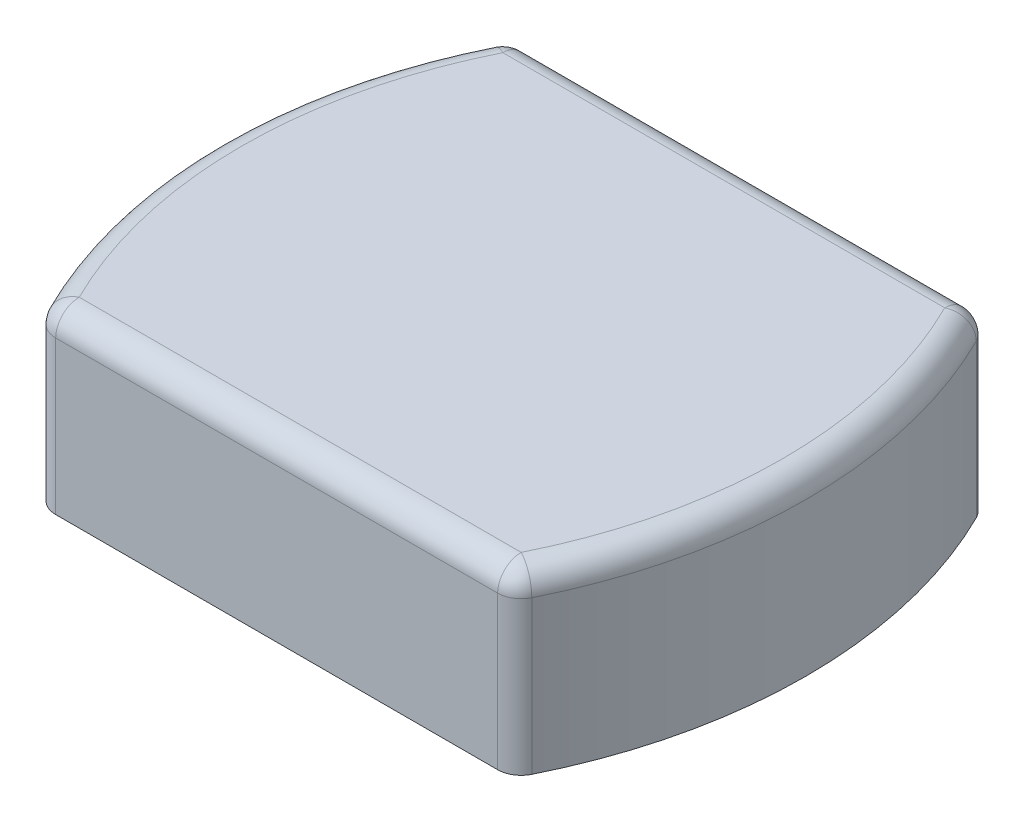
ISO-10303-21;
HEADER;
FILE_DESCRIPTION(('STEP AP214'),'2;1');
FILE_NAME('part.step','',(''),(''),'','','');
FILE_SCHEMA(('AUTOMOTIVE_DESIGN { 1 0 10303 214 1 1 1 1 }'));
ENDSEC;
DATA;
#1=APPLICATION_CONTEXT('core data for automotive mechanical design processes');
#2=APPLICATION_PROTOCOL_DEFINITION('international standard','automotive_design',2000,#1);
#3=PRODUCT_CONTEXT('',#1,'mechanical');
#4=PRODUCT('Part','Part','',(#3));
#5=PRODUCT_RELATED_PRODUCT_CATEGORY('part','',(#4));
#6=PRODUCT_DEFINITION_FORMATION('','',#4);
#7=PRODUCT_DEFINITION_CONTEXT('part definition',#1,'design');
#8=PRODUCT_DEFINITION('design','',#6,#7);
#9=PRODUCT_DEFINITION_SHAPE('','',#8);
#10=(LENGTH_UNIT() NAMED_UNIT(*) SI_UNIT(.MILLI.,.METRE.));
#11=(NAMED_UNIT(*) PLANE_ANGLE_UNIT() SI_UNIT($,.RADIAN.));
#12=(NAMED_UNIT(*) SI_UNIT($,.STERADIAN.) SOLID_ANGLE_UNIT());
#13=UNCERTAINTY_MEASURE_WITH_UNIT(LENGTH_MEASURE(1.E-05),#10,'distance_accuracy_value','');
#14=(GEOMETRIC_REPRESENTATION_CONTEXT(3) GLOBAL_UNCERTAINTY_ASSIGNED_CONTEXT((#13)) GLOBAL_UNIT_ASSIGNED_CONTEXT((#10,
#11,#12)) REPRESENTATION_CONTEXT('',''));
#15=CARTESIAN_POINT('',(0.,0.,0.));
#16=DIRECTION('',(0.,0.,1.));
#17=DIRECTION('',(1.,0.,0.));
#18=AXIS2_PLACEMENT_3D('',#15,#16,#17);
#19=CARTESIAN_POINT('',(22.2249999999999,19.05,0.));
#20=DIRECTION('',(0.,-1.,0.));
#21=DIRECTION('',(0.,0.,-1.));
#22=AXIS2_PLACEMENT_3D('',#19,#20,#21);
#23=CYLINDRICAL_SURFACE('',#22,53.975);
#24=CARTESIAN_POINT('',(22.2249999999999,0.,0.));
#25=DIRECTION('',(0.,1.,0.));
#26=DIRECTION('',(0.,0.,1.));
#27=AXIS2_PLACEMENT_3D('',#24,#25,#26);
#28=CIRCLE('',#27,53.975);
#29=CARTESIAN_POINT('',(-26.1261513293794,0.,23.9888888888889));
#30=VERTEX_POINT('',#29);
#31=CARTESIAN_POINT('',(-26.1261513293794,0.,-23.9888888888889));
#32=VERTEX_POINT('',#31);
#33=EDGE_CURVE('E181',#30,#32,#28,.F.);
#34=ORIENTED_EDGE('',*,*,#33,.F.);
#35=DIRECTION('',(0.,-1.,0.));
#36=VECTOR('',#35,1.);
#37=CARTESIAN_POINT('',(-26.1261513293794,19.05,23.9888888888889));
#38=LINE('',#37,#36);
#39=CARTESIAN_POINT('',(-26.1261513293794,16.51,23.9888888888889));
#40=VERTEX_POINT('',#39);
#41=EDGE_CURVE('E218',#30,#40,#38,.F.);
#42=ORIENTED_EDGE('',*,*,#41,.T.);
#43=CARTESIAN_POINT('',(22.2249999999999,16.51,0.));
#44=DIRECTION('',(0.,1.,0.));
#45=DIRECTION('',(0.,0.,1.));
#46=AXIS2_PLACEMENT_3D('',#43,#44,#45);
#47=CIRCLE('',#46,53.975);
#48=CARTESIAN_POINT('',(-26.1261513293794,16.51,-23.9888888888889));
#49=VERTEX_POINT('',#48);
#50=EDGE_CURVE('E216',#40,#49,#47,.F.);
#51=ORIENTED_EDGE('',*,*,#50,.T.);
#52=DIRECTION('',(0.,-1.,0.));
#53=VECTOR('',#52,1.);
#54=CARTESIAN_POINT('',(-26.1261513293794,19.05,-23.9888888888889));
#55=LINE('',#54,#53);
#56=EDGE_CURVE('E214',#49,#32,#55,.T.);
#57=ORIENTED_EDGE('',*,*,#56,.T.);
#58=EDGE_LOOP('',(#34,#42,#51,#57));
#59=FACE_BOUND('',#58,.T.);
#60=ADVANCED_FACE('F42',(#59),#23,.T.);
#61=CARTESIAN_POINT('',(0.,19.05,25.4));
#62=DIRECTION('',(0.,0.,-1.));
#63=DIRECTION('',(-1.,0.,0.));
#64=AXIS2_PLACEMENT_3D('',#61,#62,#63);
#65=PLANE('',#64);
#66=DIRECTION('',(1.,0.,0.));
#67=VECTOR('',#66,1.);
#68=CARTESIAN_POINT('',(0.,0.,25.4));
#69=LINE('',#68,#67);
#70=CARTESIAN_POINT('',(-23.8508030315262,0.,25.4));
#71=VERTEX_POINT('',#70);
#72=CARTESIAN_POINT('',(23.8508030315262,0.,25.4));
#73=VERTEX_POINT('',#72);
#74=EDGE_CURVE('E184',#71,#73,#69,.T.);
#75=ORIENTED_EDGE('',*,*,#74,.T.);
#76=DIRECTION('',(0.,1.,0.));
#77=VECTOR('',#76,1.);
#78=CARTESIAN_POINT('',(23.8508030315262,19.05,25.4));
#79=LINE('',#78,#77);
#80=CARTESIAN_POINT('',(23.8508030315262,16.51,25.4));
#81=VERTEX_POINT('',#80);
#82=EDGE_CURVE('E212',#73,#81,#79,.T.);
#83=ORIENTED_EDGE('',*,*,#82,.T.);
#84=DIRECTION('',(1.,0.,0.));
#85=VECTOR('',#84,1.);
#86=CARTESIAN_POINT('',(-25.4,16.51,25.4));
#87=LINE('',#86,#85);
#88=CARTESIAN_POINT('',(-23.8508030315262,16.51,25.4));
#89=VERTEX_POINT('',#88);
#90=EDGE_CURVE('E208',#81,#89,#87,.F.);
#91=ORIENTED_EDGE('',*,*,#90,.T.);
#92=DIRECTION('',(0.,1.,0.));
#93=VECTOR('',#92,1.);
#94=CARTESIAN_POINT('',(-23.8508030315262,0.,25.4));
#95=LINE('',#94,#93);
#96=EDGE_CURVE('E210',#89,#71,#95,.F.);
#97=ORIENTED_EDGE('',*,*,#96,.T.);
#98=EDGE_LOOP('',(#75,#83,#91,#97));
#99=FACE_BOUND('',#98,.T.);
#100=ADVANCED_FACE('F291',(#99),#65,.F.);
#101=CARTESIAN_POINT('',(-22.2249999999999,19.05,0.));
#102=DIRECTION('',(0.,-1.,0.));
#103=DIRECTION('',(0.,0.,-1.));
#104=AXIS2_PLACEMENT_3D('',#101,#102,#103);
#105=CYLINDRICAL_SURFACE('',#104,53.975);
#106=CARTESIAN_POINT('',(-22.2249999999999,16.51,0.));
#107=DIRECTION('',(0.,1.,0.));
#108=DIRECTION('',(0.,0.,1.));
#109=AXIS2_PLACEMENT_3D('',#106,#107,#108);
#110=CIRCLE('',#109,53.975);
#111=CARTESIAN_POINT('',(26.1261513293794,16.51,-23.9888888888889));
#112=VERTEX_POINT('',#111);
#113=CARTESIAN_POINT('',(26.1261513293794,16.51,23.9888888888889));
#114=VERTEX_POINT('',#113);
#115=EDGE_CURVE('E195',#112,#114,#110,.F.);
#116=ORIENTED_EDGE('',*,*,#115,.T.);
#117=DIRECTION('',(0.,-1.,0.));
#118=VECTOR('',#117,1.);
#119=CARTESIAN_POINT('',(26.1261513293794,19.05,23.9888888888889));
#120=LINE('',#119,#118);
#121=CARTESIAN_POINT('',(26.1261513293794,0.,23.9888888888889));
#122=VERTEX_POINT('',#121);
#123=EDGE_CURVE('E197',#114,#122,#120,.T.);
#124=ORIENTED_EDGE('',*,*,#123,.T.);
#125=CARTESIAN_POINT('',(-22.2249999999999,0.,0.));
#126=DIRECTION('',(0.,1.,0.));
#127=DIRECTION('',(0.,0.,1.));
#128=AXIS2_PLACEMENT_3D('',#125,#126,#127);
#129=CIRCLE('',#128,53.975);
#130=CARTESIAN_POINT('',(26.1261513293794,0.,-23.9888888888889));
#131=VERTEX_POINT('',#130);
#132=EDGE_CURVE('E187',#131,#122,#129,.F.);
#133=ORIENTED_EDGE('',*,*,#132,.F.);
#134=DIRECTION('',(0.,-1.,0.));
#135=VECTOR('',#134,1.);
#136=CARTESIAN_POINT('',(26.1261513293794,19.05,-23.9888888888889));
#137=LINE('',#136,#135);
#138=EDGE_CURVE('E193',#131,#112,#137,.F.);
#139=ORIENTED_EDGE('',*,*,#138,.T.);
#140=EDGE_LOOP('',(#116,#124,#133,#139));
#141=FACE_BOUND('',#140,.T.);
#142=ADVANCED_FACE('F297',(#141),#105,.T.);
#143=CARTESIAN_POINT('',(0.,19.05,-25.4));
#144=DIRECTION('',(0.,0.,-1.));
#145=DIRECTION('',(-1.,0.,0.));
#146=AXIS2_PLACEMENT_3D('',#143,#144,#145);
#147=PLANE('',#146);
#148=DIRECTION('',(1.,0.,0.));
#149=VECTOR('',#148,1.);
#150=CARTESIAN_POINT('',(0.,0.,-25.4));
#151=LINE('',#150,#149);
#152=CARTESIAN_POINT('',(-23.8508030315262,0.,-25.4));
#153=VERTEX_POINT('',#152);
#154=CARTESIAN_POINT('',(23.8508030315262,0.,-25.4));
#155=VERTEX_POINT('',#154);
#156=EDGE_CURVE('E190',#153,#155,#151,.T.);
#157=ORIENTED_EDGE('',*,*,#156,.F.);
#158=DIRECTION('',(0.,-1.,0.));
#159=VECTOR('',#158,1.);
#160=CARTESIAN_POINT('',(-23.8508030315262,19.05,-25.4));
#161=LINE('',#160,#159);
#162=CARTESIAN_POINT('',(-23.8508030315262,16.51,-25.4));
#163=VERTEX_POINT('',#162);
#164=EDGE_CURVE('E12',#153,#163,#161,.F.);
#165=ORIENTED_EDGE('',*,*,#164,.T.);
#166=DIRECTION('',(1.,0.,0.));
#167=VECTOR('',#166,1.);
#168=CARTESIAN_POINT('',(0.,16.51,-25.4));
#169=LINE('',#168,#167);
#170=CARTESIAN_POINT('',(23.8508030315262,16.51,-25.4));
#171=VERTEX_POINT('',#170);
#172=EDGE_CURVE('E51',#163,#171,#169,.T.);
#173=ORIENTED_EDGE('',*,*,#172,.T.);
#174=DIRECTION('',(0.,-1.,0.));
#175=VECTOR('',#174,1.);
#176=CARTESIAN_POINT('',(23.8508030315262,19.05,-25.4));
#177=LINE('',#176,#175);
#178=EDGE_CURVE('E229',#171,#155,#177,.T.);
#179=ORIENTED_EDGE('',*,*,#178,.T.);
#180=EDGE_LOOP('',(#157,#165,#173,#179));
#181=FACE_BOUND('',#180,.T.);
#182=ADVANCED_FACE('F351',(#181),#147,.T.);
#183=CARTESIAN_POINT('',(0.,19.05,0.));
#184=DIRECTION('',(0.,1.,0.));
#185=DIRECTION('',(0.,0.,1.));
#186=AXIS2_PLACEMENT_3D('',#183,#184,#185);
#187=PLANE('',#186);
#188=CARTESIAN_POINT('',(22.2249999999999,19.05,0.));
#189=DIRECTION('',(0.,1.,0.));
#190=DIRECTION('',(0.,0.,1.));
#191=AXIS2_PLACEMENT_3D('',#188,#189,#190);
#192=CIRCLE('',#191,51.435);
#193=CARTESIAN_POINT('',(-23.8508030315262,19.05,-22.86));
#194=VERTEX_POINT('',#193);
#195=CARTESIAN_POINT('',(-23.8508030315262,19.05,22.86));
#196=VERTEX_POINT('',#195);
#197=EDGE_CURVE('E222',#194,#196,#192,.T.);
#198=ORIENTED_EDGE('',*,*,#197,.T.);
#199=DIRECTION('',(1.,0.,0.));
#200=VECTOR('',#199,1.);
#201=CARTESIAN_POINT('',(25.4,19.05,22.86));
#202=LINE('',#201,#200);
#203=CARTESIAN_POINT('',(23.8508030315262,19.05,22.86));
#204=VERTEX_POINT('',#203);
#205=EDGE_CURVE('E226',#196,#204,#202,.T.);
#206=ORIENTED_EDGE('',*,*,#205,.T.);
#207=CARTESIAN_POINT('',(-22.2249999999999,19.05,0.));
#208=DIRECTION('',(0.,1.,0.));
#209=DIRECTION('',(0.,0.,1.));
#210=AXIS2_PLACEMENT_3D('',#207,#208,#209);
#211=CIRCLE('',#210,51.435);
#212=CARTESIAN_POINT('',(23.8508030315262,19.05,-22.86));
#213=VERTEX_POINT('',#212);
#214=EDGE_CURVE('E224',#204,#213,#211,.T.);
#215=ORIENTED_EDGE('',*,*,#214,.T.);
#216=DIRECTION('',(1.,0.,0.));
#217=VECTOR('',#216,1.);
#218=CARTESIAN_POINT('',(0.,19.05,-22.86));
#219=LINE('',#218,#217);
#220=EDGE_CURVE('E220',#213,#194,#219,.F.);
#221=ORIENTED_EDGE('',*,*,#220,.T.);
#222=EDGE_LOOP('',(#198,#206,#215,#221));
#223=FACE_BOUND('',#222,.T.);
#224=ADVANCED_FACE('F366',(#223),#187,.T.);
#225=CARTESIAN_POINT('',(0.,0.,0.));
#226=DIRECTION('',(0.,1.,0.));
#227=DIRECTION('',(0.,0.,1.));
#228=AXIS2_PLACEMENT_3D('',#225,#226,#227);
#229=PLANE('',#228);
#230=DIRECTION('',(0.,0.,-1.));
#231=VECTOR('',#230,1.);
#232=CARTESIAN_POINT('',(-22.86,0.,20.32));
#233=LINE('',#232,#231);
#234=CARTESIAN_POINT('',(-22.86,0.,20.32));
#235=VERTEX_POINT('',#234);
#236=CARTESIAN_POINT('',(-22.86,0.,-20.32));
#237=VERTEX_POINT('',#236);
#238=EDGE_CURVE('E166',#235,#237,#233,.T.);
#239=ORIENTED_EDGE('',*,*,#238,.F.);
#240=DIRECTION('',(-1.,0.,0.));
#241=VECTOR('',#240,1.);
#242=CARTESIAN_POINT('',(-22.86,0.,20.32));
#243=LINE('',#242,#241);
#244=CARTESIAN_POINT('',(22.86,0.,20.32));
#245=VERTEX_POINT('',#244);
#246=EDGE_CURVE('E158',#245,#235,#243,.T.);
#247=ORIENTED_EDGE('',*,*,#246,.F.);
#248=DIRECTION('',(0.,0.,1.));
#249=VECTOR('',#248,1.);
#250=CARTESIAN_POINT('',(22.86,0.,20.32));
#251=LINE('',#250,#249);
#252=CARTESIAN_POINT('',(22.86,0.,-20.32));
#253=VERTEX_POINT('',#252);
#254=EDGE_CURVE('E170',#253,#245,#251,.T.);
#255=ORIENTED_EDGE('',*,*,#254,.F.);
#256=DIRECTION('',(1.,0.,0.));
#257=VECTOR('',#256,1.);
#258=CARTESIAN_POINT('',(-22.86,0.,-20.32));
#259=LINE('',#258,#257);
#260=EDGE_CURVE('E164',#237,#253,#259,.T.);
#261=ORIENTED_EDGE('',*,*,#260,.F.);
#262=EDGE_LOOP('',(#239,#247,#255,#261));
#263=FACE_BOUND('',#262,.T.);
#264=ORIENTED_EDGE('',*,*,#132,.T.);
#265=CARTESIAN_POINT('',(23.8508030315262,0.,22.86));
#266=DIRECTION('',(0.,1.,0.));
#267=DIRECTION('',(0.,0.,1.));
#268=AXIS2_PLACEMENT_3D('',#265,#266,#267);
#269=CIRCLE('',#268,2.54);
#270=EDGE_CURVE('E206',#122,#73,#269,.F.);
#271=ORIENTED_EDGE('',*,*,#270,.T.);
#272=ORIENTED_EDGE('',*,*,#74,.F.);
#273=CARTESIAN_POINT('',(-23.8508030315262,0.,22.86));
#274=DIRECTION('',(0.,1.,0.));
#275=DIRECTION('',(0.,0.,1.));
#276=AXIS2_PLACEMENT_3D('',#273,#274,#275);
#277=CIRCLE('',#276,2.54);
#278=EDGE_CURVE('E204',#71,#30,#277,.F.);
#279=ORIENTED_EDGE('',*,*,#278,.T.);
#280=ORIENTED_EDGE('',*,*,#33,.T.);
#281=CARTESIAN_POINT('',(-23.8508030315262,0.,-22.86));
#282=DIRECTION('',(0.,1.,0.));
#283=DIRECTION('',(0.,0.,1.));
#284=AXIS2_PLACEMENT_3D('',#281,#282,#283);
#285=CIRCLE('',#284,2.54);
#286=EDGE_CURVE('E202',#32,#153,#285,.F.);
#287=ORIENTED_EDGE('',*,*,#286,.T.);
#288=ORIENTED_EDGE('',*,*,#156,.T.);
#289=CARTESIAN_POINT('',(23.8508030315262,0.,-22.86));
#290=DIRECTION('',(0.,1.,0.));
#291=DIRECTION('',(0.,0.,1.));
#292=AXIS2_PLACEMENT_3D('',#289,#290,#291);
#293=CIRCLE('',#292,2.54);
#294=EDGE_CURVE('E200',#155,#131,#293,.F.);
#295=ORIENTED_EDGE('',*,*,#294,.T.);
#296=EDGE_LOOP('',(#264,#271,#272,#279,#280,#287,#288,#295));
#297=FACE_BOUND('',#296,.T.);
#298=ADVANCED_FACE('F275',(#263,#297),#229,.F.);
#299=CARTESIAN_POINT('',(0.,15.875,0.));
#300=DIRECTION('',(0.,1.,0.));
#301=DIRECTION('',(0.,0.,1.));
#302=AXIS2_PLACEMENT_3D('',#299,#300,#301);
#303=PLANE('',#302);
#304=DIRECTION('',(0.,0.,1.));
#305=VECTOR('',#304,1.);
#306=CARTESIAN_POINT('',(22.86,15.875,20.32));
#307=LINE('',#306,#305);
#308=CARTESIAN_POINT('',(22.86,15.875,-20.32));
#309=VERTEX_POINT('',#308);
#310=CARTESIAN_POINT('',(22.86,15.875,20.32));
#311=VERTEX_POINT('',#310);
#312=EDGE_CURVE('E162',#309,#311,#307,.T.);
#313=ORIENTED_EDGE('',*,*,#312,.T.);
#314=DIRECTION('',(-1.,0.,0.));
#315=VECTOR('',#314,1.);
#316=CARTESIAN_POINT('',(-22.86,15.875,20.32));
#317=LINE('',#316,#315);
#318=CARTESIAN_POINT('',(-22.86,15.875,20.32));
#319=VERTEX_POINT('',#318);
#320=EDGE_CURVE('E155',#311,#319,#317,.T.);
#321=ORIENTED_EDGE('',*,*,#320,.T.);
#322=DIRECTION('',(0.,0.,-1.));
#323=VECTOR('',#322,1.);
#324=CARTESIAN_POINT('',(-22.86,15.875,20.32));
#325=LINE('',#324,#323);
#326=CARTESIAN_POINT('',(-22.86,15.875,-20.32));
#327=VERTEX_POINT('',#326);
#328=EDGE_CURVE('E142',#319,#327,#325,.T.);
#329=ORIENTED_EDGE('',*,*,#328,.T.);
#330=DIRECTION('',(1.,0.,0.));
#331=VECTOR('',#330,1.);
#332=CARTESIAN_POINT('',(-22.86,15.875,-20.32));
#333=LINE('',#332,#331);
#334=EDGE_CURVE('E175',#327,#309,#333,.T.);
#335=ORIENTED_EDGE('',*,*,#334,.T.);
#336=EDGE_LOOP('',(#313,#321,#329,#335));
#337=FACE_BOUND('',#336,.T.);
#338=ADVANCED_FACE('F161',(#337),#303,.F.);
#339=CARTESIAN_POINT('',(-22.86,80.2213004602649,20.32));
#340=DIRECTION('',(0.,0.,1.));
#341=DIRECTION('',(1.,0.,0.));
#342=AXIS2_PLACEMENT_3D('',#339,#340,#341);
#343=PLANE('',#342);
#344=DIRECTION('',(0.,-1.,0.));
#345=VECTOR('',#344,1.);
#346=CARTESIAN_POINT('',(22.86,80.2213004602649,20.32));
#347=LINE('',#346,#345);
#348=EDGE_CURVE('E173',#311,#245,#347,.T.);
#349=ORIENTED_EDGE('',*,*,#348,.T.);
#350=ORIENTED_EDGE('',*,*,#246,.T.);
#351=DIRECTION('',(0.,-1.,0.));
#352=VECTOR('',#351,1.);
#353=CARTESIAN_POINT('',(-22.86,80.2213004602649,20.32));
#354=LINE('',#353,#352);
#355=EDGE_CURVE('E146',#319,#235,#354,.T.);
#356=ORIENTED_EDGE('',*,*,#355,.F.);
#357=ORIENTED_EDGE('',*,*,#320,.F.);
#358=EDGE_LOOP('',(#349,#350,#356,#357));
#359=FACE_BOUND('',#358,.T.);
#360=ADVANCED_FACE('F154',(#359),#343,.F.);
#361=CARTESIAN_POINT('',(-22.86,80.2213004602649,20.32));
#362=DIRECTION('',(-1.,0.,0.));
#363=DIRECTION('',(0.,0.,1.));
#364=AXIS2_PLACEMENT_3D('',#361,#362,#363);
#365=PLANE('',#364);
#366=ORIENTED_EDGE('',*,*,#355,.T.);
#367=ORIENTED_EDGE('',*,*,#238,.T.);
#368=DIRECTION('',(0.,-1.,0.));
#369=VECTOR('',#368,1.);
#370=CARTESIAN_POINT('',(-22.86,80.2213004602649,-20.32));
#371=LINE('',#370,#369);
#372=EDGE_CURVE('E148',#327,#237,#371,.T.);
#373=ORIENTED_EDGE('',*,*,#372,.F.);
#374=ORIENTED_EDGE('',*,*,#328,.F.);
#375=EDGE_LOOP('',(#366,#367,#373,#374));
#376=FACE_BOUND('',#375,.T.);
#377=ADVANCED_FACE('F144',(#376),#365,.F.);
#378=CARTESIAN_POINT('',(-22.86,80.2213004602649,-20.32));
#379=DIRECTION('',(0.,0.,-1.));
#380=DIRECTION('',(-1.,0.,0.));
#381=AXIS2_PLACEMENT_3D('',#378,#379,#380);
#382=PLANE('',#381);
#383=ORIENTED_EDGE('',*,*,#372,.T.);
#384=ORIENTED_EDGE('',*,*,#260,.T.);
#385=DIRECTION('',(0.,-1.,0.));
#386=VECTOR('',#385,1.);
#387=CARTESIAN_POINT('',(22.86,80.2213004602649,-20.32));
#388=LINE('',#387,#386);
#389=EDGE_CURVE('E174',#309,#253,#388,.T.);
#390=ORIENTED_EDGE('',*,*,#389,.F.);
#391=ORIENTED_EDGE('',*,*,#334,.F.);
#392=EDGE_LOOP('',(#383,#384,#390,#391));
#393=FACE_BOUND('',#392,.T.);
#394=ADVANCED_FACE('F279',(#393),#382,.F.);
#395=CARTESIAN_POINT('',(22.86,80.2213004602649,20.32));
#396=DIRECTION('',(1.,0.,0.));
#397=DIRECTION('',(0.,0.,-1.));
#398=AXIS2_PLACEMENT_3D('',#395,#396,#397);
#399=PLANE('',#398);
#400=ORIENTED_EDGE('',*,*,#389,.T.);
#401=ORIENTED_EDGE('',*,*,#254,.T.);
#402=ORIENTED_EDGE('',*,*,#348,.F.);
#403=ORIENTED_EDGE('',*,*,#312,.F.);
#404=EDGE_LOOP('',(#400,#401,#402,#403));
#405=FACE_BOUND('',#404,.T.);
#406=ADVANCED_FACE('F280',(#405),#399,.F.);
#407=CARTESIAN_POINT('',(-23.8508030315262,19.05,-22.86));
#408=DIRECTION('',(0.,-1.,0.));
#409=DIRECTION('',(0.,0.,-1.));
#410=AXIS2_PLACEMENT_3D('',#407,#408,#409);
#411=CYLINDRICAL_SURFACE('',#410,2.54);
#412=CARTESIAN_POINT('',(-23.8508030315262,16.51,-22.86));
#413=DIRECTION('',(0.,1.,0.));
#414=DIRECTION('',(0.,0.,1.));
#415=AXIS2_PLACEMENT_3D('',#412,#413,#414);
#416=CIRCLE('',#415,2.54);
#417=EDGE_CURVE('E46',#163,#49,#416,.T.);
#418=ORIENTED_EDGE('',*,*,#417,.F.);
#419=ORIENTED_EDGE('',*,*,#164,.F.);
#420=ORIENTED_EDGE('',*,*,#286,.F.);
#421=ORIENTED_EDGE('',*,*,#56,.F.);
#422=EDGE_LOOP('',(#418,#419,#420,#421));
#423=FACE_BOUND('',#422,.T.);
#424=ADVANCED_FACE('F44',(#423),#411,.T.);
#425=CARTESIAN_POINT('',(-23.8508030315262,16.51,-22.86));
#426=DIRECTION('',(0.,0.,1.));
#427=DIRECTION('',(1.,0.,0.));
#428=AXIS2_PLACEMENT_3D('',#425,#426,#427);
#429=SPHERICAL_SURFACE('',#428,2.54);
#430=CARTESIAN_POINT('',(-23.8508030315262,16.51,-22.86));
#431=DIRECTION('',(-1.,0.,0.));
#432=DIRECTION('',(0.,0.,1.));
#433=AXIS2_PLACEMENT_3D('',#430,#431,#432);
#434=CIRCLE('',#433,2.54);
#435=EDGE_CURVE('E258',#163,#194,#434,.F.);
#436=ORIENTED_EDGE('',*,*,#435,.F.);
#437=ORIENTED_EDGE('',*,*,#417,.T.);
#438=CARTESIAN_POINT('',(-23.8508030315262,16.51,-22.86));
#439=DIRECTION('',(0.444444444444445,0.,-0.895806416477616));
#440=DIRECTION('',(-0.895806416477616,0.,-0.444444444444445));
#441=AXIS2_PLACEMENT_3D('',#438,#439,#440);
#442=CIRCLE('',#441,2.54);
#443=EDGE_CURVE('E260',#194,#49,#442,.F.);
#444=ORIENTED_EDGE('',*,*,#443,.F.);
#445=EDGE_LOOP('',(#436,#437,#444));
#446=FACE_BOUND('',#445,.T.);
#447=ADVANCED_FACE('F287',(#446),#429,.T.);
#448=CARTESIAN_POINT('',(-23.8508030315262,19.05,22.86));
#449=DIRECTION('',(0.,-1.,0.));
#450=DIRECTION('',(0.,0.,-1.));
#451=AXIS2_PLACEMENT_3D('',#448,#449,#450);
#452=CYLINDRICAL_SURFACE('',#451,2.54);
#453=ORIENTED_EDGE('',*,*,#278,.F.);
#454=ORIENTED_EDGE('',*,*,#96,.F.);
#455=CARTESIAN_POINT('',(-23.8508030315262,16.51,22.86));
#456=DIRECTION('',(0.,1.,0.));
#457=DIRECTION('',(0.,0.,1.));
#458=AXIS2_PLACEMENT_3D('',#455,#456,#457);
#459=CIRCLE('',#458,2.54);
#460=EDGE_CURVE('E255',#40,#89,#459,.T.);
#461=ORIENTED_EDGE('',*,*,#460,.F.);
#462=ORIENTED_EDGE('',*,*,#41,.F.);
#463=EDGE_LOOP('',(#453,#454,#461,#462));
#464=FACE_BOUND('',#463,.T.);
#465=ADVANCED_FACE('F338',(#464),#452,.T.);
#466=CARTESIAN_POINT('',(22.2249999999999,16.51,0.));
#467=DIRECTION('',(0.,1.,0.));
#468=DIRECTION('',(0.,0.,1.));
#469=AXIS2_PLACEMENT_3D('',#466,#467,#468);
#470=TOROIDAL_SURFACE('',#469,51.435,2.54);
#471=ORIENTED_EDGE('',*,*,#443,.T.);
#472=ORIENTED_EDGE('',*,*,#50,.F.);
#473=CARTESIAN_POINT('',(-23.8508030315262,16.51,22.86));
#474=DIRECTION('',(0.444444444444443,0.,0.895806416477617));
#475=DIRECTION('',(0.895806416477617,0.,-0.444444444444443));
#476=AXIS2_PLACEMENT_3D('',#473,#474,#475);
#477=CIRCLE('',#476,2.54);
#478=EDGE_CURVE('E252',#196,#40,#477,.T.);
#479=ORIENTED_EDGE('',*,*,#478,.F.);
#480=ORIENTED_EDGE('',*,*,#197,.F.);
#481=EDGE_LOOP('',(#471,#472,#479,#480));
#482=FACE_BOUND('',#481,.T.);
#483=ADVANCED_FACE('F334',(#482),#470,.T.);
#484=CARTESIAN_POINT('',(0.,16.51,-22.86));
#485=DIRECTION('',(1.,0.,0.));
#486=DIRECTION('',(0.,0.,-1.));
#487=AXIS2_PLACEMENT_3D('',#484,#485,#486);
#488=CYLINDRICAL_SURFACE('',#487,2.54);
#489=ORIENTED_EDGE('',*,*,#435,.T.);
#490=ORIENTED_EDGE('',*,*,#220,.F.);
#491=CARTESIAN_POINT('',(23.8508030315262,16.51,-22.86));
#492=DIRECTION('',(1.,0.,0.));
#493=DIRECTION('',(0.,0.,-1.));
#494=AXIS2_PLACEMENT_3D('',#491,#492,#493);
#495=CIRCLE('',#494,2.54);
#496=EDGE_CURVE('E249',#171,#213,#495,.T.);
#497=ORIENTED_EDGE('',*,*,#496,.F.);
#498=ORIENTED_EDGE('',*,*,#172,.F.);
#499=EDGE_LOOP('',(#489,#490,#497,#498));
#500=FACE_BOUND('',#499,.T.);
#501=ADVANCED_FACE('F330',(#500),#488,.T.);
#502=CARTESIAN_POINT('',(23.8508030315262,19.05,-22.86));
#503=DIRECTION('',(0.,-1.,0.));
#504=DIRECTION('',(0.,0.,-1.));
#505=AXIS2_PLACEMENT_3D('',#502,#503,#504);
#506=CYLINDRICAL_SURFACE('',#505,2.54);
#507=ORIENTED_EDGE('',*,*,#294,.F.);
#508=ORIENTED_EDGE('',*,*,#178,.F.);
#509=CARTESIAN_POINT('',(23.8508030315262,16.51,-22.86));
#510=DIRECTION('',(0.,1.,0.));
#511=DIRECTION('',(0.,0.,1.));
#512=AXIS2_PLACEMENT_3D('',#509,#510,#511);
#513=CIRCLE('',#512,2.54);
#514=EDGE_CURVE('E246',#112,#171,#513,.T.);
#515=ORIENTED_EDGE('',*,*,#514,.F.);
#516=ORIENTED_EDGE('',*,*,#138,.F.);
#517=EDGE_LOOP('',(#507,#508,#515,#516));
#518=FACE_BOUND('',#517,.T.);
#519=ADVANCED_FACE('F326',(#518),#506,.T.);
#520=CARTESIAN_POINT('',(-23.8508030315262,16.51,22.86));
#521=DIRECTION('',(0.,0.,1.));
#522=DIRECTION('',(1.,0.,0.));
#523=AXIS2_PLACEMENT_3D('',#520,#521,#522);
#524=SPHERICAL_SURFACE('',#523,2.54);
#525=ORIENTED_EDGE('',*,*,#478,.T.);
#526=ORIENTED_EDGE('',*,*,#460,.T.);
#527=CARTESIAN_POINT('',(-23.8508030315262,16.51,22.86));
#528=DIRECTION('',(-1.,0.,0.));
#529=DIRECTION('',(0.,-1.,0.));
#530=AXIS2_PLACEMENT_3D('',#527,#528,#529);
#531=CIRCLE('',#530,2.54);
#532=EDGE_CURVE('E243',#196,#89,#531,.F.);
#533=ORIENTED_EDGE('',*,*,#532,.F.);
#534=EDGE_LOOP('',(#525,#526,#533));
#535=FACE_BOUND('',#534,.T.);
#536=ADVANCED_FACE('F322',(#535),#524,.T.);
#537=CARTESIAN_POINT('',(23.8508030315262,16.51,-22.86));
#538=DIRECTION('',(0.,0.,1.));
#539=DIRECTION('',(1.,0.,0.));
#540=AXIS2_PLACEMENT_3D('',#537,#538,#539);
#541=SPHERICAL_SURFACE('',#540,2.54);
#542=ORIENTED_EDGE('',*,*,#514,.T.);
#543=ORIENTED_EDGE('',*,*,#496,.T.);
#544=CARTESIAN_POINT('',(23.8508030315262,16.51,-22.86));
#545=DIRECTION('',(-0.444444444444443,0.,-0.895806416477617));
#546=DIRECTION('',(-0.895806416477617,0.,0.444444444444443));
#547=AXIS2_PLACEMENT_3D('',#544,#545,#546);
#548=CIRCLE('',#547,2.54);
#549=EDGE_CURVE('E240',#112,#213,#548,.F.);
#550=ORIENTED_EDGE('',*,*,#549,.F.);
#551=EDGE_LOOP('',(#542,#543,#550));
#552=FACE_BOUND('',#551,.T.);
#553=ADVANCED_FACE('F318',(#552),#541,.T.);
#554=CARTESIAN_POINT('',(0.,16.51,22.86));
#555=DIRECTION('',(-1.,0.,0.));
#556=DIRECTION('',(0.,0.,1.));
#557=AXIS2_PLACEMENT_3D('',#554,#555,#556);
#558=CYLINDRICAL_SURFACE('',#557,2.54);
#559=ORIENTED_EDGE('',*,*,#532,.T.);
#560=ORIENTED_EDGE('',*,*,#90,.F.);
#561=CARTESIAN_POINT('',(23.8508030315262,16.51,22.86));
#562=DIRECTION('',(1.,0.,0.));
#563=DIRECTION('',(0.,0.,-1.));
#564=AXIS2_PLACEMENT_3D('',#561,#562,#563);
#565=CIRCLE('',#564,2.54);
#566=EDGE_CURVE('E237',#204,#81,#565,.T.);
#567=ORIENTED_EDGE('',*,*,#566,.F.);
#568=ORIENTED_EDGE('',*,*,#205,.F.);
#569=EDGE_LOOP('',(#559,#560,#567,#568));
#570=FACE_BOUND('',#569,.T.);
#571=ADVANCED_FACE('F314',(#570),#558,.T.);
#572=CARTESIAN_POINT('',(-22.2249999999999,16.51,0.));
#573=DIRECTION('',(0.,1.,0.));
#574=DIRECTION('',(0.,0.,1.));
#575=AXIS2_PLACEMENT_3D('',#572,#573,#574);
#576=TOROIDAL_SURFACE('',#575,51.435,2.54);
#577=ORIENTED_EDGE('',*,*,#549,.T.);
#578=ORIENTED_EDGE('',*,*,#214,.F.);
#579=CARTESIAN_POINT('',(23.8508030315262,16.51,22.86));
#580=DIRECTION('',(-0.444444444444445,0.,0.895806416477616));
#581=DIRECTION('',(0.895806416477616,0.,0.444444444444445));
#582=AXIS2_PLACEMENT_3D('',#579,#580,#581);
#583=CIRCLE('',#582,2.54);
#584=EDGE_CURVE('E235',#114,#204,#583,.T.);
#585=ORIENTED_EDGE('',*,*,#584,.F.);
#586=ORIENTED_EDGE('',*,*,#115,.F.);
#587=EDGE_LOOP('',(#577,#578,#585,#586));
#588=FACE_BOUND('',#587,.T.);
#589=ADVANCED_FACE('F310',(#588),#576,.T.);
#590=CARTESIAN_POINT('',(23.8508030315262,16.51,22.86));
#591=DIRECTION('',(0.,0.,1.));
#592=DIRECTION('',(1.,0.,0.));
#593=AXIS2_PLACEMENT_3D('',#590,#591,#592);
#594=SPHERICAL_SURFACE('',#593,2.54);
#595=ORIENTED_EDGE('',*,*,#584,.T.);
#596=ORIENTED_EDGE('',*,*,#566,.T.);
#597=CARTESIAN_POINT('',(23.8508030315262,16.51,22.86));
#598=DIRECTION('',(0.,1.,0.));
#599=DIRECTION('',(0.,0.,1.));
#600=AXIS2_PLACEMENT_3D('',#597,#598,#599);
#601=CIRCLE('',#600,2.54);
#602=EDGE_CURVE('E232',#114,#81,#601,.F.);
#603=ORIENTED_EDGE('',*,*,#602,.F.);
#604=EDGE_LOOP('',(#595,#596,#603));
#605=FACE_BOUND('',#604,.T.);
#606=ADVANCED_FACE('F306',(#605),#594,.T.);
#607=CARTESIAN_POINT('',(23.8508030315262,19.05,22.86));
#608=DIRECTION('',(0.,-1.,0.));
#609=DIRECTION('',(0.,0.,-1.));
#610=AXIS2_PLACEMENT_3D('',#607,#608,#609);
#611=CYLINDRICAL_SURFACE('',#610,2.54);
#612=ORIENTED_EDGE('',*,*,#602,.T.);
#613=ORIENTED_EDGE('',*,*,#82,.F.);
#614=ORIENTED_EDGE('',*,*,#270,.F.);
#615=ORIENTED_EDGE('',*,*,#123,.F.);
#616=EDGE_LOOP('',(#612,#613,#614,#615));
#617=FACE_BOUND('',#616,.T.);
#618=ADVANCED_FACE('F303',(#617),#611,.T.);
#619=CLOSED_SHELL('',(#60,#100,#142,#182,#224,#298,#338,#360,#377,#394,#406,#424,#447,#465,#483,
#501,#519,#536,#553,#571,#589,#606,#618));
#620=MANIFOLD_SOLID_BREP('B2',#619);
#621=ADVANCED_BREP_SHAPE_REPRESENTATION('',(#18,#620),#14);
#622=SHAPE_DEFINITION_REPRESENTATION(#9,#621);
ENDSEC;
END-ISO-10303-21;
